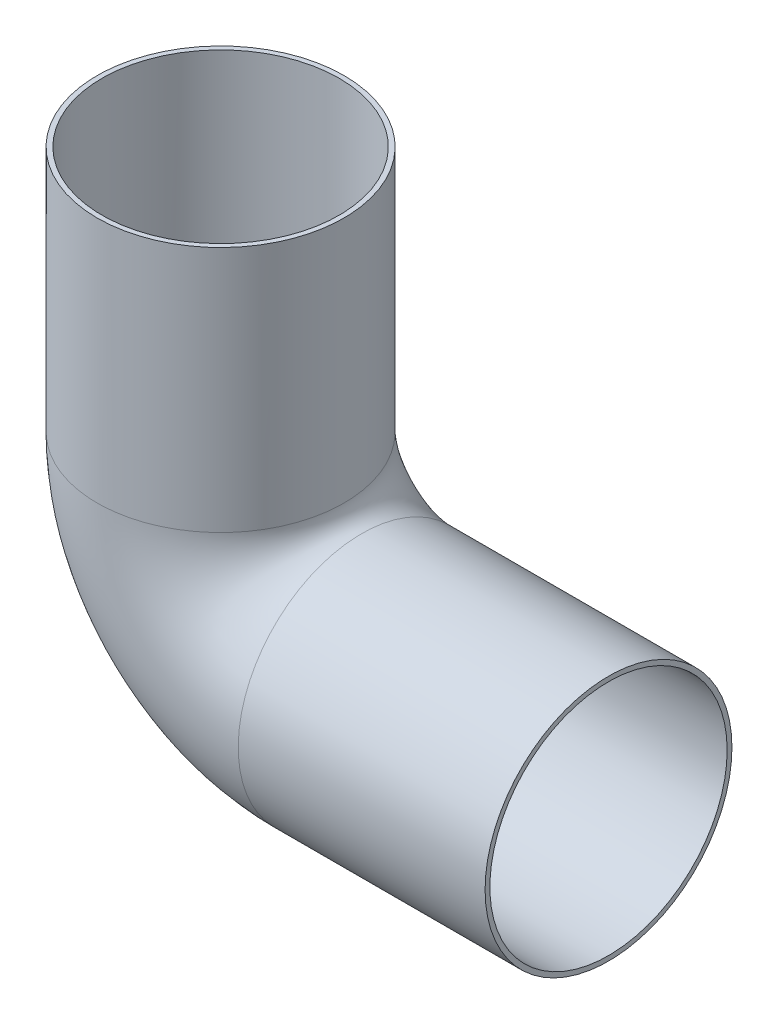
ISO-10303-21;
HEADER;
FILE_DESCRIPTION(('STEP AP214'),'2;1');
FILE_NAME('part.step','',(''),(''),'','','');
FILE_SCHEMA(('AUTOMOTIVE_DESIGN { 1 0 10303 214 1 1 1 1 }'));
ENDSEC;
DATA;
#1=APPLICATION_CONTEXT('core data for automotive mechanical design processes');
#2=APPLICATION_PROTOCOL_DEFINITION('international standard','automotive_design',2000,#1);
#3=PRODUCT_CONTEXT('',#1,'mechanical');
#4=PRODUCT('Part','Part','',(#3));
#5=PRODUCT_RELATED_PRODUCT_CATEGORY('part','',(#4));
#6=PRODUCT_DEFINITION_FORMATION('','',#4);
#7=PRODUCT_DEFINITION_CONTEXT('part definition',#1,'design');
#8=PRODUCT_DEFINITION('design','',#6,#7);
#9=PRODUCT_DEFINITION_SHAPE('','',#8);
#10=(LENGTH_UNIT() NAMED_UNIT(*) SI_UNIT(.MILLI.,.METRE.));
#11=(NAMED_UNIT(*) PLANE_ANGLE_UNIT() SI_UNIT($,.RADIAN.));
#12=(NAMED_UNIT(*) SI_UNIT($,.STERADIAN.) SOLID_ANGLE_UNIT());
#13=UNCERTAINTY_MEASURE_WITH_UNIT(LENGTH_MEASURE(1.E-05),#10,'distance_accuracy_value','');
#14=(GEOMETRIC_REPRESENTATION_CONTEXT(3) GLOBAL_UNCERTAINTY_ASSIGNED_CONTEXT((#13)) GLOBAL_UNIT_ASSIGNED_CONTEXT((#10,
#11,#12)) REPRESENTATION_CONTEXT('',''));
#15=CARTESIAN_POINT('',(0.,0.,0.));
#16=DIRECTION('',(0.,0.,1.));
#17=DIRECTION('',(1.,0.,0.));
#18=AXIS2_PLACEMENT_3D('',#15,#16,#17);
#19=CARTESIAN_POINT('',(-17.4625,17.7927575258447,0.));
#20=DIRECTION('',(0.,-1.,0.));
#21=DIRECTION('',(1.,0.,0.));
#22=AXIS2_PLACEMENT_3D('',#19,#20,#21);
#23=CYLINDRICAL_SURFACE('',#22,11.1125);
#24=CARTESIAN_POINT('',(-17.4625,-4.4322424741553,0.));
#25=DIRECTION('',(0.,-1.,0.));
#26=DIRECTION('',(0.,0.,-1.));
#27=AXIS2_PLACEMENT_3D('',#24,#25,#26);
#28=CIRCLE('',#27,11.1125);
#29=CARTESIAN_POINT('',(-28.575,-4.4322424741553,0.));
#30=VERTEX_POINT('',#29);
#31=EDGE_CURVE('E88',#30,#30,#28,.T.);
#32=ORIENTED_EDGE('',*,*,#31,.F.);
#33=EDGE_LOOP('',(#32));
#34=FACE_BOUND('',#33,.T.);
#35=CARTESIAN_POINT('',(-17.4625,17.7927575258447,0.));
#36=DIRECTION('',(0.,-1.,0.));
#37=DIRECTION('',(0.,0.,-1.));
#38=AXIS2_PLACEMENT_3D('',#35,#36,#37);
#39=CIRCLE('',#38,11.1125);
#40=CARTESIAN_POINT('',(-17.4625,17.7927575258447,-11.1125));
#41=VERTEX_POINT('',#40);
#42=EDGE_CURVE('E57',#41,#41,#39,.T.);
#43=ORIENTED_EDGE('',*,*,#42,.T.);
#44=EDGE_LOOP('',(#43));
#45=FACE_BOUND('',#44,.T.);
#46=ADVANCED_FACE('F42',(#34,#45),#23,.T.);
#47=CARTESIAN_POINT('',(-4.7625,-4.4322424741553,0.));
#48=DIRECTION('',(0.,0.,1.));
#49=DIRECTION('',(1.,0.,0.));
#50=AXIS2_PLACEMENT_3D('',#47,#48,#49);
#51=TOROIDAL_SURFACE('',#50,12.7,11.1125);
#52=CARTESIAN_POINT('',(-4.7625,-17.1322424741553,0.));
#53=DIRECTION('',(1.,0.,0.));
#54=DIRECTION('',(0.,0.,-1.));
#55=AXIS2_PLACEMENT_3D('',#52,#53,#54);
#56=CIRCLE('',#55,11.1125);
#57=CARTESIAN_POINT('',(-4.7625,-28.2447424741553,0.));
#58=VERTEX_POINT('',#57);
#59=EDGE_CURVE('E46',#58,#58,#56,.T.);
#60=CARTESIAN_POINT('',(-4.7625,-4.4322424741553,0.));
#61=DIRECTION('',(0.,0.,1.));
#62=DIRECTION('',(1.,0.,0.));
#63=AXIS2_PLACEMENT_3D('',#60,#61,#62);
#64=CIRCLE('',#63,23.8125);
#65=EDGE_CURVE('',#30,#58,#64,.T.);
#66=ORIENTED_EDGE('',*,*,#31,.T.);
#67=ORIENTED_EDGE('',*,*,#59,.F.);
#68=ORIENTED_EDGE('',*,*,#65,.T.);
#69=ORIENTED_EDGE('',*,*,#65,.F.);
#70=EDGE_LOOP('',(#66,#68,#67,#69));
#71=FACE_BOUND('',#70,.T.);
#72=ADVANCED_FACE('F96',(#71),#51,.T.);
#73=CARTESIAN_POINT('',(-4.7625,-17.1322424741553,0.));
#74=DIRECTION('',(1.,0.,0.));
#75=DIRECTION('',(0.,0.,-1.));
#76=AXIS2_PLACEMENT_3D('',#73,#74,#75);
#77=CYLINDRICAL_SURFACE('',#76,11.1125);
#78=CARTESIAN_POINT('',(17.4625,-17.1322424741553,0.));
#79=DIRECTION('',(1.,0.,0.));
#80=DIRECTION('',(0.,0.,-1.));
#81=AXIS2_PLACEMENT_3D('',#78,#79,#80);
#82=CIRCLE('',#81,11.1125);
#83=CARTESIAN_POINT('',(17.4625,-17.1322424741553,-11.1125));
#84=VERTEX_POINT('',#83);
#85=EDGE_CURVE('E62',#84,#84,#82,.T.);
#86=ORIENTED_EDGE('',*,*,#85,.F.);
#87=EDGE_LOOP('',(#86));
#88=FACE_BOUND('',#87,.T.);
#89=ORIENTED_EDGE('',*,*,#59,.T.);
#90=EDGE_LOOP('',(#89));
#91=FACE_BOUND('',#90,.T.);
#92=ADVANCED_FACE('F44',(#88,#91),#77,.T.);
#93=CARTESIAN_POINT('',(-17.4625,17.7927575258447,0.));
#94=DIRECTION('',(0.,-1.,0.));
#95=DIRECTION('',(0.,0.,-1.));
#96=AXIS2_PLACEMENT_3D('',#93,#94,#95);
#97=PLANE('',#96);
#98=CARTESIAN_POINT('',(-17.4625,17.7927575258447,0.));
#99=DIRECTION('',(0.,-1.,0.));
#100=DIRECTION('',(0.,0.,-1.));
#101=AXIS2_PLACEMENT_3D('',#98,#99,#100);
#102=CIRCLE('',#101,10.6807);
#103=CARTESIAN_POINT('',(-17.4625,17.7927575258447,-10.6807));
#104=VERTEX_POINT('',#103);
#105=EDGE_CURVE('E83',#104,#104,#102,.F.);
#106=ORIENTED_EDGE('',*,*,#105,.F.);
#107=EDGE_LOOP('',(#106));
#108=FACE_BOUND('',#107,.T.);
#109=ORIENTED_EDGE('',*,*,#42,.F.);
#110=EDGE_LOOP('',(#109));
#111=FACE_BOUND('',#110,.T.);
#112=ADVANCED_FACE('F102',(#108,#111),#97,.F.);
#113=CARTESIAN_POINT('',(17.4625,-17.1322424741553,0.));
#114=DIRECTION('',(1.,0.,0.));
#115=DIRECTION('',(0.,0.,-1.));
#116=AXIS2_PLACEMENT_3D('',#113,#114,#115);
#117=PLANE('',#116);
#118=CARTESIAN_POINT('',(17.4625,-17.1322424741553,0.));
#119=DIRECTION('',(1.,0.,0.));
#120=DIRECTION('',(0.,0.,-1.));
#121=AXIS2_PLACEMENT_3D('',#118,#119,#120);
#122=CIRCLE('',#121,10.6807);
#123=CARTESIAN_POINT('',(17.4625,-17.1322424741553,-10.6807));
#124=VERTEX_POINT('',#123);
#125=EDGE_CURVE('E13',#124,#124,#122,.F.);
#126=ORIENTED_EDGE('',*,*,#125,.T.);
#127=EDGE_LOOP('',(#126));
#128=FACE_BOUND('',#127,.T.);
#129=ORIENTED_EDGE('',*,*,#85,.T.);
#130=EDGE_LOOP('',(#129));
#131=FACE_BOUND('',#130,.T.);
#132=ADVANCED_FACE('F69',(#128,#131),#117,.T.);
#133=CARTESIAN_POINT('',(-17.4625,17.7927575258447,0.));
#134=DIRECTION('',(0.,-1.,0.));
#135=DIRECTION('',(1.,0.,0.));
#136=AXIS2_PLACEMENT_3D('',#133,#134,#135);
#137=CYLINDRICAL_SURFACE('',#136,10.6807);
#138=CARTESIAN_POINT('',(-17.4625,-4.4322424741553,0.));
#139=DIRECTION('',(0.,-1.,0.));
#140=DIRECTION('',(0.,0.,-1.));
#141=AXIS2_PLACEMENT_3D('',#138,#139,#140);
#142=CIRCLE('',#141,10.6807);
#143=CARTESIAN_POINT('',(-28.1432,-4.4322424741553,0.));
#144=VERTEX_POINT('',#143);
#145=EDGE_CURVE('E80',#144,#144,#142,.F.);
#146=ORIENTED_EDGE('',*,*,#145,.F.);
#147=EDGE_LOOP('',(#146));
#148=FACE_BOUND('',#147,.T.);
#149=ORIENTED_EDGE('',*,*,#105,.T.);
#150=EDGE_LOOP('',(#149));
#151=FACE_BOUND('',#150,.T.);
#152=ADVANCED_FACE('F110',(#148,#151),#137,.F.);
#153=CARTESIAN_POINT('',(-4.7625,-4.4322424741553,0.));
#154=DIRECTION('',(0.,0.,1.));
#155=DIRECTION('',(1.,0.,0.));
#156=AXIS2_PLACEMENT_3D('',#153,#154,#155);
#157=TOROIDAL_SURFACE('',#156,12.7,10.6807);
#158=CARTESIAN_POINT('',(-4.7625,-17.1322424741553,0.));
#159=DIRECTION('',(1.,0.,0.));
#160=DIRECTION('',(0.,0.,-1.));
#161=AXIS2_PLACEMENT_3D('',#158,#159,#160);
#162=CIRCLE('',#161,10.6807);
#163=CARTESIAN_POINT('',(-4.7625,-27.8129424741553,0.));
#164=VERTEX_POINT('',#163);
#165=EDGE_CURVE('E51',#164,#164,#162,.F.);
#166=CARTESIAN_POINT('',(-4.7625,-4.4322424741553,0.));
#167=DIRECTION('',(0.,0.,1.));
#168=DIRECTION('',(1.,0.,0.));
#169=AXIS2_PLACEMENT_3D('',#166,#167,#168);
#170=CIRCLE('',#169,23.3807);
#171=EDGE_CURVE('',#144,#164,#170,.T.);
#172=ORIENTED_EDGE('',*,*,#145,.T.);
#173=ORIENTED_EDGE('',*,*,#165,.F.);
#174=ORIENTED_EDGE('',*,*,#171,.T.);
#175=ORIENTED_EDGE('',*,*,#171,.F.);
#176=EDGE_LOOP('',(#172,#174,#173,#175));
#177=FACE_BOUND('',#176,.T.);
#178=ADVANCED_FACE('F75',(#177),#157,.F.);
#179=CARTESIAN_POINT('',(-4.7625,-17.1322424741553,0.));
#180=DIRECTION('',(1.,0.,0.));
#181=DIRECTION('',(0.,0.,-1.));
#182=AXIS2_PLACEMENT_3D('',#179,#180,#181);
#183=CYLINDRICAL_SURFACE('',#182,10.6807);
#184=ORIENTED_EDGE('',*,*,#125,.F.);
#185=EDGE_LOOP('',(#184));
#186=FACE_BOUND('',#185,.T.);
#187=ORIENTED_EDGE('',*,*,#165,.T.);
#188=EDGE_LOOP('',(#187));
#189=FACE_BOUND('',#188,.T.);
#190=ADVANCED_FACE('F72',(#186,#189),#183,.F.);
#191=CLOSED_SHELL('',(#46,#72,#92,#112,#132,#152,#178,#190));
#192=MANIFOLD_SOLID_BREP('B2',#191);
#193=ADVANCED_BREP_SHAPE_REPRESENTATION('',(#18,#192),#14);
#194=SHAPE_DEFINITION_REPRESENTATION(#9,#193);
ENDSEC;
END-ISO-10303-21;
